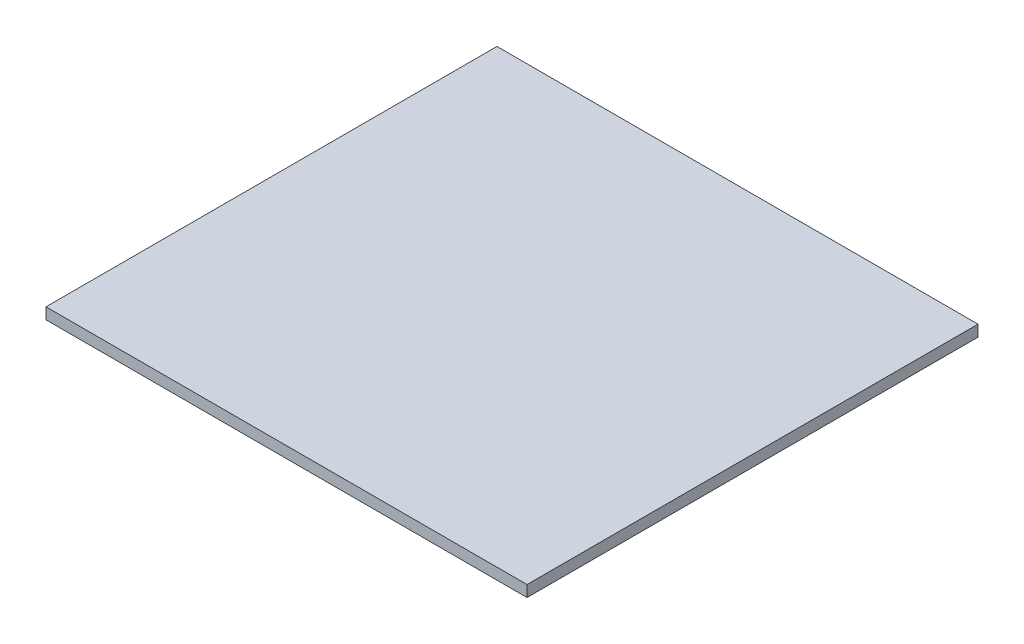
ISO-10303-21;
HEADER;
FILE_DESCRIPTION(('STEP AP214'),'2;1');
FILE_NAME('part.step','',(''),(''),'','','');
FILE_SCHEMA(('AUTOMOTIVE_DESIGN { 1 0 10303 214 1 1 1 1 }'));
ENDSEC;
DATA;
#1=APPLICATION_CONTEXT('core data for automotive mechanical design processes');
#2=APPLICATION_PROTOCOL_DEFINITION('international standard','automotive_design',2000,#1);
#3=PRODUCT_CONTEXT('',#1,'mechanical');
#4=PRODUCT('Part','Part','',(#3));
#5=PRODUCT_RELATED_PRODUCT_CATEGORY('part','',(#4));
#6=PRODUCT_DEFINITION_FORMATION('','',#4);
#7=PRODUCT_DEFINITION_CONTEXT('part definition',#1,'design');
#8=PRODUCT_DEFINITION('design','',#6,#7);
#9=PRODUCT_DEFINITION_SHAPE('','',#8);
#10=(LENGTH_UNIT() NAMED_UNIT(*) SI_UNIT(.MILLI.,.METRE.));
#11=(NAMED_UNIT(*) PLANE_ANGLE_UNIT() SI_UNIT($,.RADIAN.));
#12=(NAMED_UNIT(*) SI_UNIT($,.STERADIAN.) SOLID_ANGLE_UNIT());
#13=UNCERTAINTY_MEASURE_WITH_UNIT(LENGTH_MEASURE(1.E-05),#10,'distance_accuracy_value','');
#14=(GEOMETRIC_REPRESENTATION_CONTEXT(3) GLOBAL_UNCERTAINTY_ASSIGNED_CONTEXT((#13)) GLOBAL_UNIT_ASSIGNED_CONTEXT((#10,
#11,#12)) REPRESENTATION_CONTEXT('',''));
#15=CARTESIAN_POINT('',(0.,0.,0.));
#16=DIRECTION('',(0.,0.,1.));
#17=DIRECTION('',(1.,0.,0.));
#18=AXIS2_PLACEMENT_3D('',#15,#16,#17);
#19=CARTESIAN_POINT('',(0.,4.7625,0.));
#20=DIRECTION('',(1.,0.,0.));
#21=DIRECTION('',(0.,0.,-1.));
#22=AXIS2_PLACEMENT_3D('',#19,#20,#21);
#23=PLANE('',#22);
#24=DIRECTION('',(0.,0.,1.));
#25=VECTOR('',#24,1.);
#26=CARTESIAN_POINT('',(0.,0.,0.));
#27=LINE('',#26,#25);
#28=CARTESIAN_POINT('',(0.,0.,0.));
#29=VERTEX_POINT('',#28);
#30=CARTESIAN_POINT('',(0.,0.,190.5));
#31=VERTEX_POINT('',#30);
#32=EDGE_CURVE('E96',#29,#31,#27,.T.);
#33=ORIENTED_EDGE('',*,*,#32,.T.);
#34=DIRECTION('',(0.,-1.,0.));
#35=VECTOR('',#34,1.);
#36=CARTESIAN_POINT('',(0.,4.7625,190.5));
#37=LINE('',#36,#35);
#38=CARTESIAN_POINT('',(0.,4.7625,190.5));
#39=VERTEX_POINT('',#38);
#40=EDGE_CURVE('E11',#39,#31,#37,.T.);
#41=ORIENTED_EDGE('',*,*,#40,.F.);
#42=DIRECTION('',(0.,0.,1.));
#43=VECTOR('',#42,1.);
#44=CARTESIAN_POINT('',(0.,4.7625,0.));
#45=LINE('',#44,#43);
#46=CARTESIAN_POINT('',(0.,4.7625,0.));
#47=VERTEX_POINT('',#46);
#48=EDGE_CURVE('E82',#47,#39,#45,.T.);
#49=ORIENTED_EDGE('',*,*,#48,.F.);
#50=DIRECTION('',(0.,-1.,0.));
#51=VECTOR('',#50,1.);
#52=CARTESIAN_POINT('',(0.,4.7625,0.));
#53=LINE('',#52,#51);
#54=EDGE_CURVE('E49',#47,#29,#53,.T.);
#55=ORIENTED_EDGE('',*,*,#54,.T.);
#56=EDGE_LOOP('',(#33,#41,#49,#55));
#57=FACE_BOUND('',#56,.T.);
#58=ADVANCED_FACE('F33',(#57),#23,.F.);
#59=CARTESIAN_POINT('',(0.,4.7625,190.5));
#60=DIRECTION('',(0.,0.,-1.));
#61=DIRECTION('',(-1.,0.,0.));
#62=AXIS2_PLACEMENT_3D('',#59,#60,#61);
#63=PLANE('',#62);
#64=DIRECTION('',(1.,0.,0.));
#65=VECTOR('',#64,1.);
#66=CARTESIAN_POINT('',(0.,0.,190.5));
#67=LINE('',#66,#65);
#68=CARTESIAN_POINT('',(203.2,0.,190.5));
#69=VERTEX_POINT('',#68);
#70=EDGE_CURVE('E87',#31,#69,#67,.T.);
#71=ORIENTED_EDGE('',*,*,#70,.T.);
#72=DIRECTION('',(0.,-1.,0.));
#73=VECTOR('',#72,1.);
#74=CARTESIAN_POINT('',(203.2,4.7625,190.5));
#75=LINE('',#74,#73);
#76=CARTESIAN_POINT('',(203.2,4.7625,190.5));
#77=VERTEX_POINT('',#76);
#78=EDGE_CURVE('E41',#77,#69,#75,.T.);
#79=ORIENTED_EDGE('',*,*,#78,.F.);
#80=DIRECTION('',(1.,0.,0.));
#81=VECTOR('',#80,1.);
#82=CARTESIAN_POINT('',(0.,4.7625,190.5));
#83=LINE('',#82,#81);
#84=EDGE_CURVE('E74',#39,#77,#83,.T.);
#85=ORIENTED_EDGE('',*,*,#84,.F.);
#86=ORIENTED_EDGE('',*,*,#40,.T.);
#87=EDGE_LOOP('',(#71,#79,#85,#86));
#88=FACE_BOUND('',#87,.T.);
#89=ADVANCED_FACE('F86',(#88),#63,.F.);
#90=CARTESIAN_POINT('',(203.2,4.7625,0.));
#91=DIRECTION('',(1.,0.,0.));
#92=DIRECTION('',(0.,0.,-1.));
#93=AXIS2_PLACEMENT_3D('',#90,#91,#92);
#94=PLANE('',#93);
#95=DIRECTION('',(0.,0.,1.));
#96=VECTOR('',#95,1.);
#97=CARTESIAN_POINT('',(203.2,0.,0.));
#98=LINE('',#97,#96);
#99=CARTESIAN_POINT('',(203.2,0.,0.));
#100=VERTEX_POINT('',#99);
#101=EDGE_CURVE('E99',#100,#69,#98,.T.);
#102=ORIENTED_EDGE('',*,*,#101,.F.);
#103=DIRECTION('',(0.,-1.,0.));
#104=VECTOR('',#103,1.);
#105=CARTESIAN_POINT('',(203.2,4.7625,0.));
#106=LINE('',#105,#104);
#107=CARTESIAN_POINT('',(203.2,4.7625,0.));
#108=VERTEX_POINT('',#107);
#109=EDGE_CURVE('E63',#108,#100,#106,.T.);
#110=ORIENTED_EDGE('',*,*,#109,.F.);
#111=DIRECTION('',(0.,0.,1.));
#112=VECTOR('',#111,1.);
#113=CARTESIAN_POINT('',(203.2,4.7625,0.));
#114=LINE('',#113,#112);
#115=EDGE_CURVE('E81',#108,#77,#114,.T.);
#116=ORIENTED_EDGE('',*,*,#115,.T.);
#117=ORIENTED_EDGE('',*,*,#78,.T.);
#118=EDGE_LOOP('',(#102,#110,#116,#117));
#119=FACE_BOUND('',#118,.T.);
#120=ADVANCED_FACE('F90',(#119),#94,.T.);
#121=CARTESIAN_POINT('',(0.,4.7625,0.));
#122=DIRECTION('',(0.,0.,-1.));
#123=DIRECTION('',(-1.,0.,0.));
#124=AXIS2_PLACEMENT_3D('',#121,#122,#123);
#125=PLANE('',#124);
#126=DIRECTION('',(1.,0.,0.));
#127=VECTOR('',#126,1.);
#128=CARTESIAN_POINT('',(0.,0.,0.));
#129=LINE('',#128,#127);
#130=EDGE_CURVE('E101',#29,#100,#129,.T.);
#131=ORIENTED_EDGE('',*,*,#130,.F.);
#132=ORIENTED_EDGE('',*,*,#54,.F.);
#133=DIRECTION('',(1.,0.,0.));
#134=VECTOR('',#133,1.);
#135=CARTESIAN_POINT('',(0.,4.7625,0.));
#136=LINE('',#135,#134);
#137=EDGE_CURVE('E91',#47,#108,#136,.T.);
#138=ORIENTED_EDGE('',*,*,#137,.T.);
#139=ORIENTED_EDGE('',*,*,#109,.T.);
#140=EDGE_LOOP('',(#131,#132,#138,#139));
#141=FACE_BOUND('',#140,.T.);
#142=ADVANCED_FACE('F107',(#141),#125,.T.);
#143=CARTESIAN_POINT('',(0.,4.7625,0.));
#144=DIRECTION('',(0.,1.,0.));
#145=DIRECTION('',(0.,0.,1.));
#146=AXIS2_PLACEMENT_3D('',#143,#144,#145);
#147=PLANE('',#146);
#148=ORIENTED_EDGE('',*,*,#48,.T.);
#149=ORIENTED_EDGE('',*,*,#84,.T.);
#150=ORIENTED_EDGE('',*,*,#115,.F.);
#151=ORIENTED_EDGE('',*,*,#137,.F.);
#152=EDGE_LOOP('',(#148,#149,#150,#151));
#153=FACE_BOUND('',#152,.T.);
#154=ADVANCED_FACE('F78',(#153),#147,.T.);
#155=CARTESIAN_POINT('',(0.,0.,0.));
#156=DIRECTION('',(0.,1.,0.));
#157=DIRECTION('',(0.,0.,1.));
#158=AXIS2_PLACEMENT_3D('',#155,#156,#157);
#159=PLANE('',#158);
#160=ORIENTED_EDGE('',*,*,#32,.F.);
#161=ORIENTED_EDGE('',*,*,#130,.T.);
#162=ORIENTED_EDGE('',*,*,#101,.T.);
#163=ORIENTED_EDGE('',*,*,#70,.F.);
#164=EDGE_LOOP('',(#160,#161,#162,#163));
#165=FACE_BOUND('',#164,.T.);
#166=ADVANCED_FACE('F106',(#165),#159,.F.);
#167=CLOSED_SHELL('',(#58,#89,#120,#142,#154,#166));
#168=MANIFOLD_SOLID_BREP('B2',#167);
#169=ADVANCED_BREP_SHAPE_REPRESENTATION('',(#18,#168),#14);
#170=SHAPE_DEFINITION_REPRESENTATION(#9,#169);
ENDSEC;
END-ISO-10303-21;
